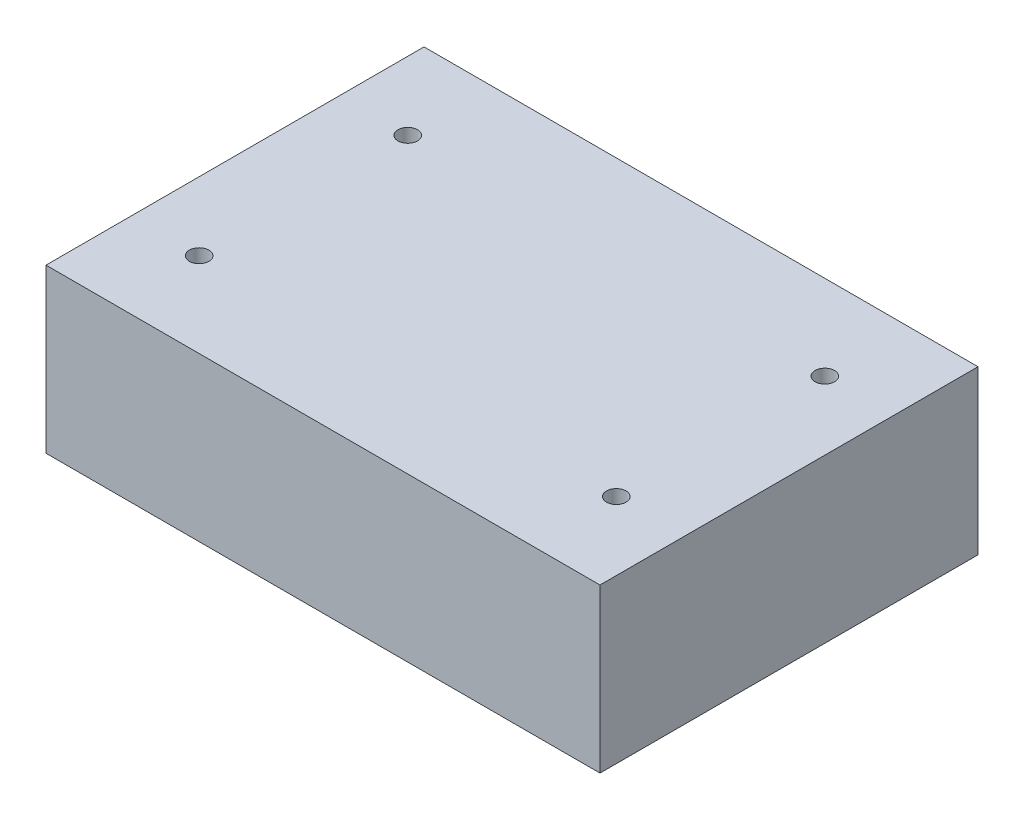
ISO-10303-21;
HEADER;
FILE_DESCRIPTION(('STEP AP214'),'2;1');
FILE_NAME('part.step','',(''),(''),'','','');
FILE_SCHEMA(('AUTOMOTIVE_DESIGN { 1 0 10303 214 1 1 1 1 }'));
ENDSEC;
DATA;
#1=APPLICATION_CONTEXT('core data for automotive mechanical design processes');
#2=APPLICATION_PROTOCOL_DEFINITION('international standard','automotive_design',2000,#1);
#3=PRODUCT_CONTEXT('',#1,'mechanical');
#4=PRODUCT('Part','Part','',(#3));
#5=PRODUCT_RELATED_PRODUCT_CATEGORY('part','',(#4));
#6=PRODUCT_DEFINITION_FORMATION('','',#4);
#7=PRODUCT_DEFINITION_CONTEXT('part definition',#1,'design');
#8=PRODUCT_DEFINITION('design','',#6,#7);
#9=PRODUCT_DEFINITION_SHAPE('','',#8);
#10=(LENGTH_UNIT() NAMED_UNIT(*) SI_UNIT(.MILLI.,.METRE.));
#11=(NAMED_UNIT(*) PLANE_ANGLE_UNIT() SI_UNIT($,.RADIAN.));
#12=(NAMED_UNIT(*) SI_UNIT($,.STERADIAN.) SOLID_ANGLE_UNIT());
#13=UNCERTAINTY_MEASURE_WITH_UNIT(LENGTH_MEASURE(1.E-05),#10,'distance_accuracy_value','');
#14=(GEOMETRIC_REPRESENTATION_CONTEXT(3) GLOBAL_UNCERTAINTY_ASSIGNED_CONTEXT((#13)) GLOBAL_UNIT_ASSIGNED_CONTEXT((#10,
#11,#12)) REPRESENTATION_CONTEXT('',''));
#15=CARTESIAN_POINT('',(0.,0.,0.));
#16=DIRECTION('',(0.,0.,1.));
#17=DIRECTION('',(1.,0.,0.));
#18=AXIS2_PLACEMENT_3D('',#15,#16,#17);
#19=CARTESIAN_POINT('',(0.,25.,0.));
#20=DIRECTION('',(0.,-1.,0.));
#21=DIRECTION('',(0.,0.,-1.));
#22=AXIS2_PLACEMENT_3D('',#19,#20,#21);
#23=PLANE('',#22);
#24=DIRECTION('',(0.,0.,1.));
#25=VECTOR('',#24,1.);
#26=CARTESIAN_POINT('',(0.,25.,0.));
#27=LINE('',#26,#25);
#28=CARTESIAN_POINT('',(0.,25.,-58.));
#29=VERTEX_POINT('',#28);
#30=CARTESIAN_POINT('',(0.,25.,0.));
#31=VERTEX_POINT('',#30);
#32=EDGE_CURVE('E86',#29,#31,#27,.T.);
#33=ORIENTED_EDGE('',*,*,#32,.T.);
#34=DIRECTION('',(1.,0.,0.));
#35=VECTOR('',#34,1.);
#36=CARTESIAN_POINT('',(0.,25.,0.));
#37=LINE('',#36,#35);
#38=CARTESIAN_POINT('',(85.,25.,0.));
#39=VERTEX_POINT('',#38);
#40=EDGE_CURVE('E81',#31,#39,#37,.T.);
#41=ORIENTED_EDGE('',*,*,#40,.T.);
#42=DIRECTION('',(0.,0.,-1.));
#43=VECTOR('',#42,1.);
#44=CARTESIAN_POINT('',(85.,25.,0.));
#45=LINE('',#44,#43);
#46=CARTESIAN_POINT('',(85.,25.,-58.));
#47=VERTEX_POINT('',#46);
#48=EDGE_CURVE('E84',#39,#47,#45,.T.);
#49=ORIENTED_EDGE('',*,*,#48,.T.);
#50=DIRECTION('',(-1.,0.,0.));
#51=VECTOR('',#50,1.);
#52=CARTESIAN_POINT('',(0.,25.,-58.));
#53=LINE('',#52,#51);
#54=EDGE_CURVE('E51',#47,#29,#53,.T.);
#55=ORIENTED_EDGE('',*,*,#54,.T.);
#56=EDGE_LOOP('',(#33,#41,#49,#55));
#57=FACE_BOUND('',#56,.T.);
#58=CARTESIAN_POINT('',(10.5,25.,-45.));
#59=DIRECTION('',(0.,1.,0.));
#60=DIRECTION('',(0.,0.,1.));
#61=AXIS2_PLACEMENT_3D('',#58,#59,#60);
#62=CIRCLE('',#61,1.5);
#63=CARTESIAN_POINT('',(10.5,25.,-43.5));
#64=VERTEX_POINT('',#63);
#65=EDGE_CURVE('E101',#64,#64,#62,.T.);
#66=ORIENTED_EDGE('',*,*,#65,.F.);
#67=EDGE_LOOP('',(#66));
#68=FACE_BOUND('',#67,.T.);
#69=CARTESIAN_POINT('',(74.5,25.,-45.));
#70=DIRECTION('',(0.,1.,0.));
#71=DIRECTION('',(0.,0.,-1.));
#72=AXIS2_PLACEMENT_3D('',#69,#70,#71);
#73=CIRCLE('',#72,1.50000000000001);
#74=CARTESIAN_POINT('',(74.5,25.,-46.5));
#75=VERTEX_POINT('',#74);
#76=EDGE_CURVE('E116',#75,#75,#73,.T.);
#77=ORIENTED_EDGE('',*,*,#76,.F.);
#78=EDGE_LOOP('',(#77));
#79=FACE_BOUND('',#78,.T.);
#80=CARTESIAN_POINT('',(74.5,25.,-13.));
#81=DIRECTION('',(0.,1.,0.));
#82=DIRECTION('',(0.,0.,1.));
#83=AXIS2_PLACEMENT_3D('',#80,#81,#82);
#84=CIRCLE('',#83,1.50000000000001);
#85=CARTESIAN_POINT('',(74.5,25.,-11.5));
#86=VERTEX_POINT('',#85);
#87=EDGE_CURVE('E122',#86,#86,#84,.T.);
#88=ORIENTED_EDGE('',*,*,#87,.F.);
#89=EDGE_LOOP('',(#88));
#90=FACE_BOUND('',#89,.T.);
#91=CARTESIAN_POINT('',(10.5,25.,-13.));
#92=DIRECTION('',(0.,1.,0.));
#93=DIRECTION('',(0.,0.,-1.));
#94=AXIS2_PLACEMENT_3D('',#91,#92,#93);
#95=CIRCLE('',#94,1.5);
#96=CARTESIAN_POINT('',(10.5,25.,-14.5));
#97=VERTEX_POINT('',#96);
#98=EDGE_CURVE('E128',#97,#97,#95,.T.);
#99=ORIENTED_EDGE('',*,*,#98,.F.);
#100=EDGE_LOOP('',(#99));
#101=FACE_BOUND('',#100,.T.);
#102=ADVANCED_FACE('F34',(#57,#68,#79,#90,#101),#23,.F.);
#103=CARTESIAN_POINT('',(0.,0.,0.));
#104=DIRECTION('',(0.,-1.,0.));
#105=DIRECTION('',(0.,0.,-1.));
#106=AXIS2_PLACEMENT_3D('',#103,#104,#105);
#107=PLANE('',#106);
#108=CARTESIAN_POINT('',(74.5,0.,-13.));
#109=DIRECTION('',(0.,1.,0.));
#110=DIRECTION('',(0.,0.,1.));
#111=AXIS2_PLACEMENT_3D('',#108,#109,#110);
#112=CIRCLE('',#111,1.50000000000001);
#113=CARTESIAN_POINT('',(74.5,0.,-11.5));
#114=VERTEX_POINT('',#113);
#115=EDGE_CURVE('E125',#114,#114,#112,.T.);
#116=ORIENTED_EDGE('',*,*,#115,.T.);
#117=EDGE_LOOP('',(#116));
#118=FACE_BOUND('',#117,.T.);
#119=CARTESIAN_POINT('',(10.5,0.,-45.));
#120=DIRECTION('',(0.,1.,0.));
#121=DIRECTION('',(0.,0.,1.));
#122=AXIS2_PLACEMENT_3D('',#119,#120,#121);
#123=CIRCLE('',#122,1.5);
#124=CARTESIAN_POINT('',(10.5,0.,-43.5));
#125=VERTEX_POINT('',#124);
#126=EDGE_CURVE('E113',#125,#125,#123,.T.);
#127=ORIENTED_EDGE('',*,*,#126,.T.);
#128=EDGE_LOOP('',(#127));
#129=FACE_BOUND('',#128,.T.);
#130=DIRECTION('',(0.,0.,1.));
#131=VECTOR('',#130,1.);
#132=CARTESIAN_POINT('',(0.,0.,0.));
#133=LINE('',#132,#131);
#134=CARTESIAN_POINT('',(0.,0.,-58.));
#135=VERTEX_POINT('',#134);
#136=CARTESIAN_POINT('',(0.,0.,0.));
#137=VERTEX_POINT('',#136);
#138=EDGE_CURVE('E98',#135,#137,#133,.T.);
#139=ORIENTED_EDGE('',*,*,#138,.F.);
#140=DIRECTION('',(-1.,0.,0.));
#141=VECTOR('',#140,1.);
#142=CARTESIAN_POINT('',(0.,0.,-58.));
#143=LINE('',#142,#141);
#144=CARTESIAN_POINT('',(85.,0.,-58.));
#145=VERTEX_POINT('',#144);
#146=EDGE_CURVE('E74',#145,#135,#143,.T.);
#147=ORIENTED_EDGE('',*,*,#146,.F.);
#148=DIRECTION('',(0.,0.,-1.));
#149=VECTOR('',#148,1.);
#150=CARTESIAN_POINT('',(85.,0.,0.));
#151=LINE('',#150,#149);
#152=CARTESIAN_POINT('',(85.,0.,0.));
#153=VERTEX_POINT('',#152);
#154=EDGE_CURVE('E68',#153,#145,#151,.T.);
#155=ORIENTED_EDGE('',*,*,#154,.F.);
#156=DIRECTION('',(1.,0.,0.));
#157=VECTOR('',#156,1.);
#158=CARTESIAN_POINT('',(0.,0.,0.));
#159=LINE('',#158,#157);
#160=EDGE_CURVE('E90',#137,#153,#159,.T.);
#161=ORIENTED_EDGE('',*,*,#160,.F.);
#162=EDGE_LOOP('',(#139,#147,#155,#161));
#163=FACE_BOUND('',#162,.T.);
#164=CARTESIAN_POINT('',(74.5,0.,-45.));
#165=DIRECTION('',(0.,1.,0.));
#166=DIRECTION('',(0.,0.,-1.));
#167=AXIS2_PLACEMENT_3D('',#164,#165,#166);
#168=CIRCLE('',#167,1.50000000000001);
#169=CARTESIAN_POINT('',(74.5,0.,-46.5));
#170=VERTEX_POINT('',#169);
#171=EDGE_CURVE('E119',#170,#170,#168,.T.);
#172=ORIENTED_EDGE('',*,*,#171,.T.);
#173=EDGE_LOOP('',(#172));
#174=FACE_BOUND('',#173,.T.);
#175=CARTESIAN_POINT('',(10.5,0.,-13.));
#176=DIRECTION('',(0.,1.,0.));
#177=DIRECTION('',(0.,0.,-1.));
#178=AXIS2_PLACEMENT_3D('',#175,#176,#177);
#179=CIRCLE('',#178,1.5);
#180=CARTESIAN_POINT('',(10.5,0.,-14.5));
#181=VERTEX_POINT('',#180);
#182=EDGE_CURVE('E131',#181,#181,#179,.T.);
#183=ORIENTED_EDGE('',*,*,#182,.T.);
#184=EDGE_LOOP('',(#183));
#185=FACE_BOUND('',#184,.T.);
#186=ADVANCED_FACE('F109',(#118,#129,#163,#174,#185),#107,.T.);
#187=CARTESIAN_POINT('',(0.,25.,0.));
#188=DIRECTION('',(1.,0.,0.));
#189=DIRECTION('',(0.,0.,-1.));
#190=AXIS2_PLACEMENT_3D('',#187,#188,#189);
#191=PLANE('',#190);
#192=ORIENTED_EDGE('',*,*,#138,.T.);
#193=DIRECTION('',(0.,-1.,0.));
#194=VECTOR('',#193,1.);
#195=CARTESIAN_POINT('',(0.,25.,0.));
#196=LINE('',#195,#194);
#197=EDGE_CURVE('E11',#31,#137,#196,.T.);
#198=ORIENTED_EDGE('',*,*,#197,.F.);
#199=ORIENTED_EDGE('',*,*,#32,.F.);
#200=DIRECTION('',(0.,-1.,0.));
#201=VECTOR('',#200,1.);
#202=CARTESIAN_POINT('',(0.,25.,-58.));
#203=LINE('',#202,#201);
#204=EDGE_CURVE('E94',#29,#135,#203,.T.);
#205=ORIENTED_EDGE('',*,*,#204,.T.);
#206=EDGE_LOOP('',(#192,#198,#199,#205));
#207=FACE_BOUND('',#206,.T.);
#208=ADVANCED_FACE('F36',(#207),#191,.F.);
#209=CARTESIAN_POINT('',(0.,25.,0.));
#210=DIRECTION('',(0.,0.,-1.));
#211=DIRECTION('',(-1.,0.,0.));
#212=AXIS2_PLACEMENT_3D('',#209,#210,#211);
#213=PLANE('',#212);
#214=ORIENTED_EDGE('',*,*,#160,.T.);
#215=DIRECTION('',(0.,-1.,0.));
#216=VECTOR('',#215,1.);
#217=CARTESIAN_POINT('',(85.,25.,0.));
#218=LINE('',#217,#216);
#219=EDGE_CURVE('E43',#39,#153,#218,.T.);
#220=ORIENTED_EDGE('',*,*,#219,.F.);
#221=ORIENTED_EDGE('',*,*,#40,.F.);
#222=ORIENTED_EDGE('',*,*,#197,.T.);
#223=EDGE_LOOP('',(#214,#220,#221,#222));
#224=FACE_BOUND('',#223,.T.);
#225=ADVANCED_FACE('F89',(#224),#213,.F.);
#226=CARTESIAN_POINT('',(85.,25.,0.));
#227=DIRECTION('',(-1.,0.,0.));
#228=DIRECTION('',(0.,0.,1.));
#229=AXIS2_PLACEMENT_3D('',#226,#227,#228);
#230=PLANE('',#229);
#231=ORIENTED_EDGE('',*,*,#154,.T.);
#232=DIRECTION('',(0.,-1.,0.));
#233=VECTOR('',#232,1.);
#234=CARTESIAN_POINT('',(85.,25.,-58.));
#235=LINE('',#234,#233);
#236=EDGE_CURVE('E91',#47,#145,#235,.T.);
#237=ORIENTED_EDGE('',*,*,#236,.F.);
#238=ORIENTED_EDGE('',*,*,#48,.F.);
#239=ORIENTED_EDGE('',*,*,#219,.T.);
#240=EDGE_LOOP('',(#231,#237,#238,#239));
#241=FACE_BOUND('',#240,.T.);
#242=ADVANCED_FACE('F92',(#241),#230,.F.);
#243=CARTESIAN_POINT('',(0.,25.,-58.));
#244=DIRECTION('',(0.,0.,1.));
#245=DIRECTION('',(1.,0.,0.));
#246=AXIS2_PLACEMENT_3D('',#243,#244,#245);
#247=PLANE('',#246);
#248=ORIENTED_EDGE('',*,*,#146,.T.);
#249=ORIENTED_EDGE('',*,*,#204,.F.);
#250=ORIENTED_EDGE('',*,*,#54,.F.);
#251=ORIENTED_EDGE('',*,*,#236,.T.);
#252=EDGE_LOOP('',(#248,#249,#250,#251));
#253=FACE_BOUND('',#252,.T.);
#254=ADVANCED_FACE('F106',(#253),#247,.F.);
#255=CARTESIAN_POINT('',(10.5,25.,-45.));
#256=DIRECTION('',(0.,-1.,0.));
#257=DIRECTION('',(0.,0.,-1.));
#258=AXIS2_PLACEMENT_3D('',#255,#256,#257);
#259=CYLINDRICAL_SURFACE('',#258,1.5);
#260=ORIENTED_EDGE('',*,*,#65,.T.);
#261=EDGE_LOOP('',(#260));
#262=FACE_BOUND('',#261,.T.);
#263=ORIENTED_EDGE('',*,*,#126,.F.);
#264=EDGE_LOOP('',(#263));
#265=FACE_BOUND('',#264,.T.);
#266=ADVANCED_FACE('F148',(#262,#265),#259,.F.);
#267=CARTESIAN_POINT('',(74.5,25.,-45.));
#268=DIRECTION('',(0.,-1.,0.));
#269=DIRECTION('',(0.,0.,-1.));
#270=AXIS2_PLACEMENT_3D('',#267,#268,#269);
#271=CYLINDRICAL_SURFACE('',#270,1.50000000000001);
#272=ORIENTED_EDGE('',*,*,#76,.T.);
#273=EDGE_LOOP('',(#272));
#274=FACE_BOUND('',#273,.T.);
#275=ORIENTED_EDGE('',*,*,#171,.F.);
#276=EDGE_LOOP('',(#275));
#277=FACE_BOUND('',#276,.T.);
#278=ADVANCED_FACE('F194',(#274,#277),#271,.F.);
#279=CARTESIAN_POINT('',(74.5,25.,-13.));
#280=DIRECTION('',(0.,-1.,0.));
#281=DIRECTION('',(0.,0.,-1.));
#282=AXIS2_PLACEMENT_3D('',#279,#280,#281);
#283=CYLINDRICAL_SURFACE('',#282,1.50000000000001);
#284=ORIENTED_EDGE('',*,*,#87,.T.);
#285=EDGE_LOOP('',(#284));
#286=FACE_BOUND('',#285,.T.);
#287=ORIENTED_EDGE('',*,*,#115,.F.);
#288=EDGE_LOOP('',(#287));
#289=FACE_BOUND('',#288,.T.);
#290=ADVANCED_FACE('F202',(#286,#289),#283,.F.);
#291=CARTESIAN_POINT('',(10.5,25.,-13.));
#292=DIRECTION('',(0.,-1.,0.));
#293=DIRECTION('',(0.,0.,-1.));
#294=AXIS2_PLACEMENT_3D('',#291,#292,#293);
#295=CYLINDRICAL_SURFACE('',#294,1.5);
#296=ORIENTED_EDGE('',*,*,#98,.T.);
#297=EDGE_LOOP('',(#296));
#298=FACE_BOUND('',#297,.T.);
#299=ORIENTED_EDGE('',*,*,#182,.F.);
#300=EDGE_LOOP('',(#299));
#301=FACE_BOUND('',#300,.T.);
#302=ADVANCED_FACE('F137',(#298,#301),#295,.F.);
#303=CLOSED_SHELL('',(#102,#186,#208,#225,#242,#254,#266,#278,#290,#302));
#304=MANIFOLD_SOLID_BREP('B2',#303);
#305=ADVANCED_BREP_SHAPE_REPRESENTATION('',(#18,#304),#14);
#306=SHAPE_DEFINITION_REPRESENTATION(#9,#305);
ENDSEC;
END-ISO-10303-21;
